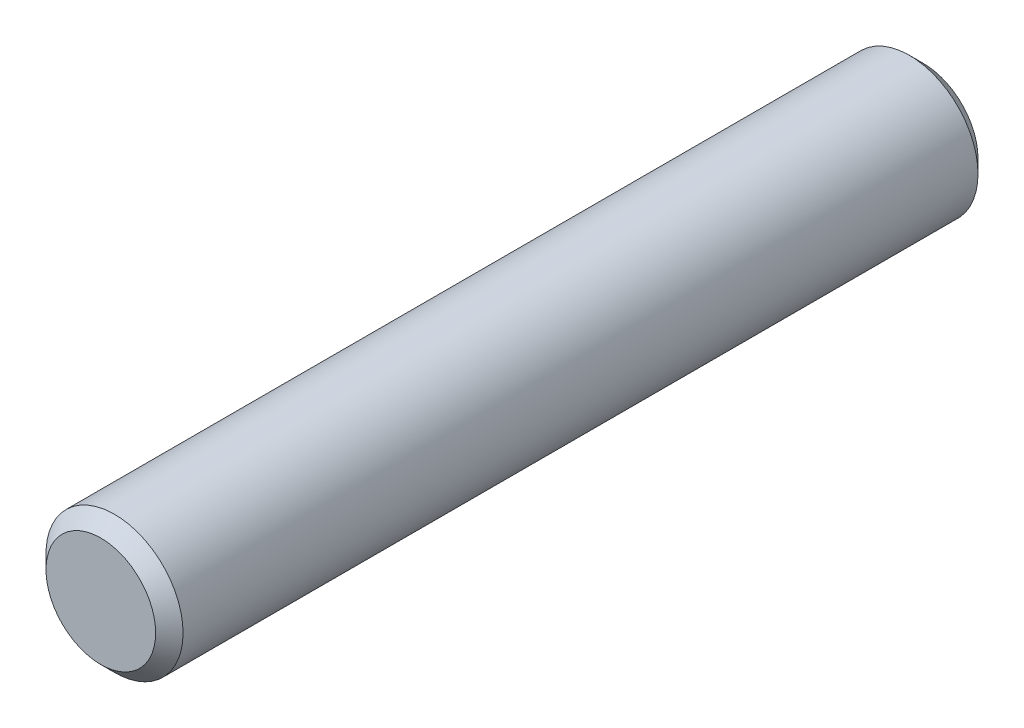
ISO-10303-21;
HEADER;
FILE_DESCRIPTION(('STEP AP214'),'2;1');
FILE_NAME('part.step','',(''),(''),'','','');
FILE_SCHEMA(('AUTOMOTIVE_DESIGN { 1 0 10303 214 1 1 1 1 }'));
ENDSEC;
DATA;
#1=APPLICATION_CONTEXT('core data for automotive mechanical design processes');
#2=APPLICATION_PROTOCOL_DEFINITION('international standard','automotive_design',2000,#1);
#3=PRODUCT_CONTEXT('',#1,'mechanical');
#4=PRODUCT('Part','Part','',(#3));
#5=PRODUCT_RELATED_PRODUCT_CATEGORY('part','',(#4));
#6=PRODUCT_DEFINITION_FORMATION('','',#4);
#7=PRODUCT_DEFINITION_CONTEXT('part definition',#1,'design');
#8=PRODUCT_DEFINITION('design','',#6,#7);
#9=PRODUCT_DEFINITION_SHAPE('','',#8);
#10=(LENGTH_UNIT() NAMED_UNIT(*) SI_UNIT(.MILLI.,.METRE.));
#11=(NAMED_UNIT(*) PLANE_ANGLE_UNIT() SI_UNIT($,.RADIAN.));
#12=(NAMED_UNIT(*) SI_UNIT($,.STERADIAN.) SOLID_ANGLE_UNIT());
#13=UNCERTAINTY_MEASURE_WITH_UNIT(LENGTH_MEASURE(1.E-05),#10,'distance_accuracy_value','');
#14=(GEOMETRIC_REPRESENTATION_CONTEXT(3) GLOBAL_UNCERTAINTY_ASSIGNED_CONTEXT((#13)) GLOBAL_UNIT_ASSIGNED_CONTEXT((#10,
#11,#12)) REPRESENTATION_CONTEXT('',''));
#15=CARTESIAN_POINT('',(0.,0.,0.));
#16=DIRECTION('',(0.,0.,1.));
#17=DIRECTION('',(1.,0.,0.));
#18=AXIS2_PLACEMENT_3D('',#15,#16,#17);
#19=CARTESIAN_POINT('',(0.,0.,9.));
#20=DIRECTION('',(0.,0.,-1.));
#21=DIRECTION('',(-1.,0.,0.));
#22=AXIS2_PLACEMENT_3D('',#19,#20,#21);
#23=CYLINDRICAL_SURFACE('',#22,1.5);
#24=CARTESIAN_POINT('',(0.,0.,-8.7));
#25=DIRECTION('',(0.,0.,1.));
#26=DIRECTION('',(1.,0.,0.));
#27=AXIS2_PLACEMENT_3D('',#24,#25,#26);
#28=CIRCLE('',#27,1.5);
#29=CARTESIAN_POINT('',(1.5,0.,-8.7));
#30=VERTEX_POINT('',#29);
#31=EDGE_CURVE('E27',#30,#30,#28,.T.);
#32=ORIENTED_EDGE('',*,*,#31,.T.);
#33=EDGE_LOOP('',(#32));
#34=FACE_BOUND('',#33,.T.);
#35=CARTESIAN_POINT('',(0.,0.,8.7));
#36=DIRECTION('',(0.,0.,1.));
#37=DIRECTION('',(1.,0.,0.));
#38=AXIS2_PLACEMENT_3D('',#35,#36,#37);
#39=CIRCLE('',#38,1.5);
#40=CARTESIAN_POINT('',(1.5,0.,8.7));
#41=VERTEX_POINT('',#40);
#42=EDGE_CURVE('E31',#41,#41,#39,.F.);
#43=ORIENTED_EDGE('',*,*,#42,.T.);
#44=EDGE_LOOP('',(#43));
#45=FACE_BOUND('',#44,.T.);
#46=ADVANCED_FACE('F15',(#34,#45),#23,.T.);
#47=CARTESIAN_POINT('',(0.,0.,9.));
#48=DIRECTION('',(0.,0.,1.));
#49=DIRECTION('',(1.,0.,0.));
#50=AXIS2_PLACEMENT_3D('',#47,#48,#49);
#51=PLANE('',#50);
#52=CARTESIAN_POINT('',(0.,0.,9.));
#53=DIRECTION('',(0.,0.,1.));
#54=DIRECTION('',(1.,0.,0.));
#55=AXIS2_PLACEMENT_3D('',#52,#53,#54);
#56=CIRCLE('',#55,1.2);
#57=CARTESIAN_POINT('',(1.2,0.,9.));
#58=VERTEX_POINT('',#57);
#59=EDGE_CURVE('E10',#58,#58,#56,.T.);
#60=ORIENTED_EDGE('',*,*,#59,.T.);
#61=EDGE_LOOP('',(#60));
#62=FACE_BOUND('',#61,.T.);
#63=ADVANCED_FACE('F49',(#62),#51,.T.);
#64=CARTESIAN_POINT('',(0.,0.,-9.));
#65=DIRECTION('',(0.,0.,1.));
#66=DIRECTION('',(1.,0.,0.));
#67=AXIS2_PLACEMENT_3D('',#64,#65,#66);
#68=PLANE('',#67);
#69=CARTESIAN_POINT('',(0.,0.,-9.));
#70=DIRECTION('',(0.,0.,1.));
#71=DIRECTION('',(1.,0.,0.));
#72=AXIS2_PLACEMENT_3D('',#69,#70,#71);
#73=CIRCLE('',#72,1.2);
#74=CARTESIAN_POINT('',(1.2,0.,-9.));
#75=VERTEX_POINT('',#74);
#76=EDGE_CURVE('E23',#75,#75,#73,.F.);
#77=ORIENTED_EDGE('',*,*,#76,.T.);
#78=EDGE_LOOP('',(#77));
#79=FACE_BOUND('',#78,.T.);
#80=ADVANCED_FACE('F46',(#79),#68,.F.);
#81=CARTESIAN_POINT('',(0.,0.,-8.7));
#82=DIRECTION('',(0.,0.,1.));
#83=DIRECTION('',(1.,0.,0.));
#84=AXIS2_PLACEMENT_3D('',#81,#82,#83);
#85=CONICAL_SURFACE('',#84,1.5,0.785398163397455);
#86=ORIENTED_EDGE('',*,*,#76,.F.);
#87=EDGE_LOOP('',(#86));
#88=FACE_BOUND('',#87,.T.);
#89=ORIENTED_EDGE('',*,*,#31,.F.);
#90=EDGE_LOOP('',(#89));
#91=FACE_BOUND('',#90,.T.);
#92=ADVANCED_FACE('F40',(#88,#91),#85,.T.);
#93=CARTESIAN_POINT('',(0.,0.,9.));
#94=DIRECTION('',(0.,0.,-1.));
#95=DIRECTION('',(-1.,0.,0.));
#96=AXIS2_PLACEMENT_3D('',#93,#94,#95);
#97=CONICAL_SURFACE('',#96,1.2,0.785398163397443);
#98=ORIENTED_EDGE('',*,*,#42,.F.);
#99=EDGE_LOOP('',(#98));
#100=FACE_BOUND('',#99,.T.);
#101=ORIENTED_EDGE('',*,*,#59,.F.);
#102=EDGE_LOOP('',(#101));
#103=FACE_BOUND('',#102,.T.);
#104=ADVANCED_FACE('F18',(#100,#103),#97,.T.);
#105=CLOSED_SHELL('',(#46,#63,#80,#92,#104));
#106=MANIFOLD_SOLID_BREP('B1',#105);
#107=ADVANCED_BREP_SHAPE_REPRESENTATION('',(#18,#106),#14);
#108=SHAPE_DEFINITION_REPRESENTATION(#9,#107);
ENDSEC;
END-ISO-10303-21;
